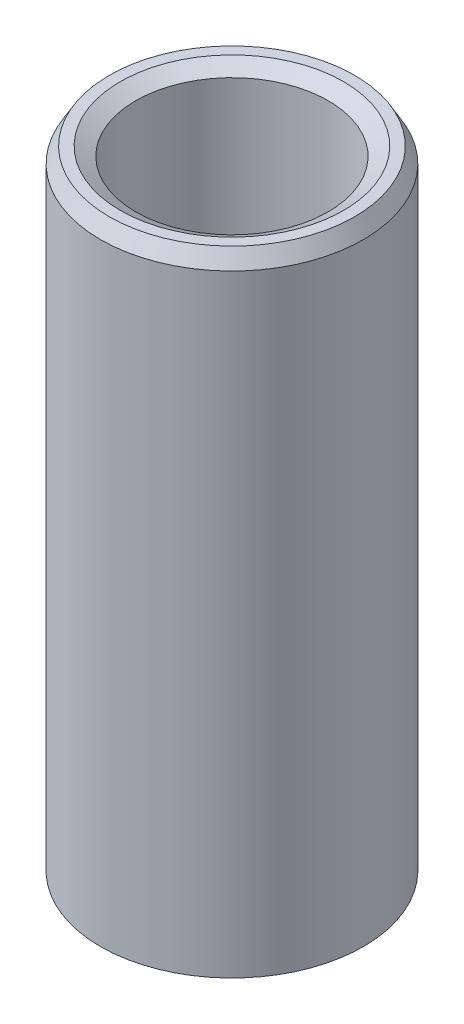
ISO-10303-21;
HEADER;
FILE_DESCRIPTION(('STEP AP214'),'2;1');
FILE_NAME('part.step','',(''),(''),'','','');
FILE_SCHEMA(('AUTOMOTIVE_DESIGN { 1 0 10303 214 1 1 1 1 }'));
ENDSEC;
DATA;
#1=APPLICATION_CONTEXT('core data for automotive mechanical design processes');
#2=APPLICATION_PROTOCOL_DEFINITION('international standard','automotive_design',2000,#1);
#3=PRODUCT_CONTEXT('',#1,'mechanical');
#4=PRODUCT('Part','Part','',(#3));
#5=PRODUCT_RELATED_PRODUCT_CATEGORY('part','',(#4));
#6=PRODUCT_DEFINITION_FORMATION('','',#4);
#7=PRODUCT_DEFINITION_CONTEXT('part definition',#1,'design');
#8=PRODUCT_DEFINITION('design','',#6,#7);
#9=PRODUCT_DEFINITION_SHAPE('','',#8);
#10=(LENGTH_UNIT() NAMED_UNIT(*) SI_UNIT(.MILLI.,.METRE.));
#11=(NAMED_UNIT(*) PLANE_ANGLE_UNIT() SI_UNIT($,.RADIAN.));
#12=(NAMED_UNIT(*) SI_UNIT($,.STERADIAN.) SOLID_ANGLE_UNIT());
#13=UNCERTAINTY_MEASURE_WITH_UNIT(LENGTH_MEASURE(1.E-05),#10,'distance_accuracy_value','');
#14=(GEOMETRIC_REPRESENTATION_CONTEXT(3) GLOBAL_UNCERTAINTY_ASSIGNED_CONTEXT((#13)) GLOBAL_UNIT_ASSIGNED_CONTEXT((#10,
#11,#12)) REPRESENTATION_CONTEXT('',''));
#15=CARTESIAN_POINT('',(0.,0.,0.));
#16=DIRECTION('',(0.,0.,1.));
#17=DIRECTION('',(1.,0.,0.));
#18=AXIS2_PLACEMENT_3D('',#15,#16,#17);
#19=CARTESIAN_POINT('',(0.,133.156342285421,0.));
#20=DIRECTION('',(0.,-1.,0.));
#21=DIRECTION('',(0.,0.,-1.));
#22=AXIS2_PLACEMENT_3D('',#19,#20,#21);
#23=CYLINDRICAL_SURFACE('',#22,27.5);
#24=CARTESIAN_POINT('',(0.,1.85242086561793,0.));
#25=DIRECTION('',(0.,1.,0.));
#26=DIRECTION('',(0.,0.,1.));
#27=AXIS2_PLACEMENT_3D('',#24,#25,#26);
#28=CIRCLE('',#27,27.5);
#29=CARTESIAN_POINT('',(0.,1.85242086561793,27.5));
#30=VERTEX_POINT('',#29);
#31=EDGE_CURVE('E10',#30,#30,#28,.T.);
#32=ORIENTED_EDGE('',*,*,#31,.T.);
#33=EDGE_LOOP('',(#32));
#34=FACE_BOUND('',#33,.T.);
#35=CARTESIAN_POINT('',(0.,129.94785522917,0.));
#36=DIRECTION('',(0.,1.,0.));
#37=DIRECTION('',(0.,0.,1.));
#38=AXIS2_PLACEMENT_3D('',#35,#36,#37);
#39=CIRCLE('',#38,27.5);
#40=CARTESIAN_POINT('',(0.,129.94785522917,27.5));
#41=VERTEX_POINT('',#40);
#42=EDGE_CURVE('E50',#41,#41,#39,.F.);
#43=ORIENTED_EDGE('',*,*,#42,.T.);
#44=EDGE_LOOP('',(#43));
#45=FACE_BOUND('',#44,.T.);
#46=ADVANCED_FACE('F39',(#34,#45),#23,.T.);
#47=CARTESIAN_POINT('',(0.,133.156342285421,0.));
#48=DIRECTION('',(0.,1.,0.));
#49=DIRECTION('',(0.,0.,1.));
#50=AXIS2_PLACEMENT_3D('',#47,#48,#49);
#51=PLANE('',#50);
#52=CARTESIAN_POINT('',(0.,133.156342285421,0.));
#53=DIRECTION('',(0.,1.,0.));
#54=DIRECTION('',(0.,0.,1.));
#55=AXIS2_PLACEMENT_3D('',#52,#53,#54);
#56=CIRCLE('',#55,23.3527264931606);
#57=CARTESIAN_POINT('',(0.,133.156342285421,23.3527264931605));
#58=VERTEX_POINT('',#57);
#59=EDGE_CURVE('E58',#58,#58,#56,.F.);
#60=ORIENTED_EDGE('',*,*,#59,.T.);
#61=EDGE_LOOP('',(#60));
#62=FACE_BOUND('',#61,.T.);
#63=CARTESIAN_POINT('',(0.,133.156342285421,0.));
#64=DIRECTION('',(0.,1.,0.));
#65=DIRECTION('',(0.,0.,1.));
#66=AXIS2_PLACEMENT_3D('',#63,#64,#65);
#67=CIRCLE('',#66,25.647579134382);
#68=CARTESIAN_POINT('',(0.,133.156342285421,25.647579134382));
#69=VERTEX_POINT('',#68);
#70=EDGE_CURVE('E61',#69,#69,#67,.T.);
#71=ORIENTED_EDGE('',*,*,#70,.T.);
#72=EDGE_LOOP('',(#71));
#73=FACE_BOUND('',#72,.T.);
#74=ADVANCED_FACE('F88',(#62,#73),#51,.T.);
#75=CARTESIAN_POINT('',(0.,0.,0.));
#76=DIRECTION('',(0.,1.,0.));
#77=DIRECTION('',(0.,0.,1.));
#78=AXIS2_PLACEMENT_3D('',#75,#76,#77);
#79=PLANE('',#78);
#80=CARTESIAN_POINT('',(0.,0.,0.));
#81=DIRECTION('',(0.,1.,0.));
#82=DIRECTION('',(0.,0.,1.));
#83=AXIS2_PLACEMENT_3D('',#80,#81,#82);
#84=CIRCLE('',#83,21.9966603025275);
#85=CARTESIAN_POINT('',(0.,0.,21.9966603025275));
#86=VERTEX_POINT('',#85);
#87=EDGE_CURVE('E51',#86,#86,#84,.T.);
#88=ORIENTED_EDGE('',*,*,#87,.T.);
#89=EDGE_LOOP('',(#88));
#90=FACE_BOUND('',#89,.T.);
#91=CARTESIAN_POINT('',(0.,0.,0.));
#92=DIRECTION('',(0.,1.,0.));
#93=DIRECTION('',(0.,0.,1.));
#94=AXIS2_PLACEMENT_3D('',#91,#92,#93);
#95=CIRCLE('',#94,24.291512943749);
#96=CARTESIAN_POINT('',(0.,0.,24.291512943749));
#97=VERTEX_POINT('',#96);
#98=EDGE_CURVE('E54',#97,#97,#95,.F.);
#99=ORIENTED_EDGE('',*,*,#98,.T.);
#100=EDGE_LOOP('',(#99));
#101=FACE_BOUND('',#100,.T.);
#102=ADVANCED_FACE('F83',(#90,#101),#79,.F.);
#103=CARTESIAN_POINT('',(0.,133.156342285421,0.));
#104=DIRECTION('',(0.,-1.,0.));
#105=DIRECTION('',(0.,0.,-1.));
#106=AXIS2_PLACEMENT_3D('',#103,#104,#105);
#107=CYLINDRICAL_SURFACE('',#106,20.1442394369096);
#108=CARTESIAN_POINT('',(0.,131.303921419804,0.));
#109=DIRECTION('',(0.,1.,0.));
#110=DIRECTION('',(0.,0.,1.));
#111=AXIS2_PLACEMENT_3D('',#108,#109,#110);
#112=CIRCLE('',#111,20.1442394369096);
#113=CARTESIAN_POINT('',(0.,131.303921419804,20.1442394369096));
#114=VERTEX_POINT('',#113);
#115=EDGE_CURVE('E67',#114,#114,#112,.T.);
#116=ORIENTED_EDGE('',*,*,#115,.T.);
#117=EDGE_LOOP('',(#116));
#118=FACE_BOUND('',#117,.T.);
#119=CARTESIAN_POINT('',(0.,3.20848705625099,0.));
#120=DIRECTION('',(0.,1.,0.));
#121=DIRECTION('',(0.,0.,1.));
#122=AXIS2_PLACEMENT_3D('',#119,#120,#121);
#123=CIRCLE('',#122,20.1442394369096);
#124=CARTESIAN_POINT('',(0.,3.20848705625099,20.1442394369096));
#125=VERTEX_POINT('',#124);
#126=EDGE_CURVE('E69',#125,#125,#123,.F.);
#127=ORIENTED_EDGE('',*,*,#126,.T.);
#128=EDGE_LOOP('',(#127));
#129=FACE_BOUND('',#128,.T.);
#130=ADVANCED_FACE('F71',(#118,#129),#107,.F.);
#131=CARTESIAN_POINT('',(0.,131.303921419804,0.));
#132=DIRECTION('',(0.,1.,0.));
#133=DIRECTION('',(0.,0.,1.));
#134=AXIS2_PLACEMENT_3D('',#131,#132,#133);
#135=CONICAL_SURFACE('',#134,20.1442394369096,1.0471975511966);
#136=CARTESIAN_POINT('',(0.,133.156342285421,23.3527264931605));
#137=CARTESIAN_POINT('',(0.,133.137046234738,23.3193047529913));
#138=CARTESIAN_POINT('',(0.,133.117750184054,23.285883012822));
#139=CARTESIAN_POINT('',(0.,133.079158082687,23.2190395324834));
#140=CARTESIAN_POINT('',(0.,133.059862032004,23.1856177923141));
#141=CARTESIAN_POINT('',(0.,133.021269930637,23.1187743119756));
#142=CARTESIAN_POINT('',(0.,133.001973879953,23.0853525718063));
#143=CARTESIAN_POINT('',(0.,132.963381778586,23.0185090914677));
#144=CARTESIAN_POINT('',(0.,132.944085727903,22.9850873512984));
#145=CARTESIAN_POINT('',(0.,132.905493626536,22.9182438709599));
#146=CARTESIAN_POINT('',(0.,132.886197575852,22.8848221307906));
#147=CARTESIAN_POINT('',(0.,132.847605474485,22.817978650452));
#148=CARTESIAN_POINT('',(0.,132.828309423802,22.7845569102828));
#149=CARTESIAN_POINT('',(0.,132.789717322435,22.7177134299442));
#150=CARTESIAN_POINT('',(0.,132.770421271751,22.6842916897749));
#151=CARTESIAN_POINT('',(0.,132.731829170384,22.6174482094364));
#152=CARTESIAN_POINT('',(0.,132.7125331197,22.5840264692671));
#153=CARTESIAN_POINT('',(0.,132.673941018333,22.5171829889285));
#154=CARTESIAN_POINT('',(0.,132.65464496765,22.4837612487592));
#155=CARTESIAN_POINT('',(0.,132.616052866283,22.4169177684207));
#156=CARTESIAN_POINT('',(0.,132.596756815599,22.3834960282514));
#157=CARTESIAN_POINT('',(0.,132.558164714232,22.3166525479128));
#158=CARTESIAN_POINT('',(0.,132.538868663549,22.2832308077435));
#159=CARTESIAN_POINT('',(0.,132.500276562182,22.216387327405));
#160=CARTESIAN_POINT('',(0.,132.480980511498,22.1829655872357));
#161=CARTESIAN_POINT('',(0.,132.442388410131,22.1161221068971));
#162=CARTESIAN_POINT('',(0.,132.423092359448,22.0827003667279));
#163=CARTESIAN_POINT('',(0.,132.384500258081,22.0158568863893));
#164=CARTESIAN_POINT('',(0.,132.365204207397,21.98243514622));
#165=CARTESIAN_POINT('',(0.,132.32661210603,21.9155916658815));
#166=CARTESIAN_POINT('',(0.,132.307316055347,21.8821699257122));
#167=CARTESIAN_POINT('',(0.,132.26872395398,21.8153264453736));
#168=CARTESIAN_POINT('',(0.,132.249427903296,21.7819047052043));
#169=CARTESIAN_POINT('',(0.,132.210835801929,21.7150612248658));
#170=CARTESIAN_POINT('',(0.,132.191539751245,21.6816394846965));
#171=CARTESIAN_POINT('',(0.,132.152947649878,21.6147960043579));
#172=CARTESIAN_POINT('',(0.,132.133651599195,21.5813742641886));
#173=CARTESIAN_POINT('',(0.,132.095059497828,21.5145307838501));
#174=CARTESIAN_POINT('',(0.,132.075763447144,21.4811090436808));
#175=CARTESIAN_POINT('',(0.,132.037171345777,21.4142655633422));
#176=CARTESIAN_POINT('',(0.,132.017875295094,21.380843823173));
#177=CARTESIAN_POINT('',(0.,131.979283193727,21.3140003428344));
#178=CARTESIAN_POINT('',(0.,131.959987143043,21.2805786026651));
#179=CARTESIAN_POINT('',(0.,131.921395041676,21.2137351223266));
#180=CARTESIAN_POINT('',(0.,131.902098990993,21.1803133821573));
#181=CARTESIAN_POINT('',(0.,131.863506889626,21.1134699018187));
#182=CARTESIAN_POINT('',(0.,131.844210838942,21.0800481616494));
#183=CARTESIAN_POINT('',(0.,131.805618737575,21.0132046813109));
#184=CARTESIAN_POINT('',(0.,131.786322686892,20.9797829411416));
#185=CARTESIAN_POINT('',(0.,131.747730585524,20.912939460803));
#186=CARTESIAN_POINT('',(0.,131.728434534841,20.8795177206338));
#187=CARTESIAN_POINT('',(0.,131.689842433474,20.8126742402952));
#188=CARTESIAN_POINT('',(0.,131.67054638279,20.7792525001259));
#189=CARTESIAN_POINT('',(0.,131.631954281423,20.7124090197873));
#190=CARTESIAN_POINT('',(0.,131.61265823074,20.6789872796181));
#191=CARTESIAN_POINT('',(0.,131.574066129373,20.6121437992795));
#192=CARTESIAN_POINT('',(0.,131.554770078689,20.5787220591102));
#193=CARTESIAN_POINT('',(0.,131.516177977322,20.5118785787717));
#194=CARTESIAN_POINT('',(0.,131.496881926639,20.4784568386024));
#195=CARTESIAN_POINT('',(0.,131.458289825272,20.4116133582638));
#196=CARTESIAN_POINT('',(0.,131.438993774588,20.3781916180945));
#197=CARTESIAN_POINT('',(0.,131.400401673221,20.311348137756));
#198=CARTESIAN_POINT('',(0.,131.381105622538,20.2779263975867));
#199=CARTESIAN_POINT('',(0.,131.342513521171,20.2110829172481));
#200=CARTESIAN_POINT('',(0.,131.323217470487,20.1776611770789));
#201=CARTESIAN_POINT('',(0.,131.303921419804,20.1442394369096));
#202=B_SPLINE_CURVE_WITH_KNOTS('',3,(#136,#137,#138,#139,#140,#141,#142,#143,#144,#145,#146,
#147,#148,#149,#150,#151,#152,#153,#154,#155,#156,#157,#158,#159,#160,#161,#162,#163,#164,#165,
#166,#167,#168,#169,#170,#171,#172,#173,#174,#175,#176,#177,#178,#179,#180,#181,#182,#183,#184,
#185,#186,#187,#188,#189,#190,#191,#192,#193,#194,#195,#196,#197,#198,#199,#200,#201),
.UNSPECIFIED.,.F.,.F.,(4,2,2,2,2,2,2,2,2,2,2,2,2,2,2,2,2,2,2,2,2,2,2,2,2,2,2,2,2,2,2,2,4),(0.,
0.115776304101124,0.231552608202251,0.347328912303364,0.463105216404491,0.578881520505604,
0.694657824606731,0.810434128707842,0.926210432808969,1.0419867369101,1.15776304101121,
1.27353934511234,1.38931564921345,1.50509195331457,1.62086825741569,1.73664456151681,
1.85242086561793,1.96819716971905,2.08397347382018,2.19974977792129,2.31552608202242,
2.43130238612353,2.54707869022466,2.66285499432577,2.77863129842689,2.89440760252802,
3.01018390662913,3.12596021073026,3.24173651483137,3.3575128189325,3.47328912303361,
3.58906542713474,3.70484173123585),.UNSPECIFIED.);
#203=EDGE_CURVE('BSEAM77',#58,#114,#202,.T.);
#204=ORIENTED_EDGE('',*,*,#59,.F.);
#205=ORIENTED_EDGE('',*,*,#115,.F.);
#206=ORIENTED_EDGE('',*,*,#203,.T.);
#207=ORIENTED_EDGE('',*,*,#203,.F.);
#208=EDGE_LOOP('',(#204,#206,#205,#207));
#209=FACE_BOUND('',#208,.T.);
#210=ADVANCED_FACE('F77',(#209),#135,.F.);
#211=CARTESIAN_POINT('',(0.,0.,0.));
#212=DIRECTION('',(0.,-1.,0.));
#213=DIRECTION('',(0.,0.,-1.));
#214=AXIS2_PLACEMENT_3D('',#211,#212,#213);
#215=CONICAL_SURFACE('',#214,21.9966603025275,0.523598775598298);
#216=ORIENTED_EDGE('',*,*,#126,.F.);
#217=EDGE_LOOP('',(#216));
#218=FACE_BOUND('',#217,.T.);
#219=ORIENTED_EDGE('',*,*,#87,.F.);
#220=EDGE_LOOP('',(#219));
#221=FACE_BOUND('',#220,.T.);
#222=ADVANCED_FACE('F73',(#218,#221),#215,.F.);
#223=CARTESIAN_POINT('',(0.,1.85242086561793,0.));
#224=DIRECTION('',(0.,1.,0.));
#225=DIRECTION('',(0.,0.,1.));
#226=AXIS2_PLACEMENT_3D('',#223,#224,#225);
#227=CONICAL_SURFACE('',#226,27.5,1.0471975511966);
#228=CARTESIAN_POINT('',(0.,0.,24.291512943749));
#229=CARTESIAN_POINT('',(0.,0.0192960506835199,24.3249346839183));
#230=CARTESIAN_POINT('',(0.,0.03859210136704,24.3583564240876));
#231=CARTESIAN_POINT('',(0.,0.0771842027340803,24.4251999044261));
#232=CARTESIAN_POINT('',(0.,0.0964802534176004,24.4586216445954));
#233=CARTESIAN_POINT('',(0.,0.135072354784641,24.525465124934));
#234=CARTESIAN_POINT('',(0.,0.154368405468161,24.5588868651033));
#235=CARTESIAN_POINT('',(0.,0.192960506835201,24.6257303454418));
#236=CARTESIAN_POINT('',(0.,0.212256557518721,24.6591520856111));
#237=CARTESIAN_POINT('',(0.,0.250848658885761,24.7259955659497));
#238=CARTESIAN_POINT('',(0.,0.270144709569282,24.7594173061189));
#239=CARTESIAN_POINT('',(0.,0.308736810936322,24.8262607864575));
#240=CARTESIAN_POINT('',(0.,0.328032861619842,24.8596825266268));
#241=CARTESIAN_POINT('',(0.,0.366624962986882,24.9265260069654));
#242=CARTESIAN_POINT('',(0.,0.385921013670402,24.9599477471346));
#243=CARTESIAN_POINT('',(0.,0.424513115037443,25.0267912274732));
#244=CARTESIAN_POINT('',(0.,0.443809165720963,25.0602129676425));
#245=CARTESIAN_POINT('',(0.,0.482401267088003,25.127056447981));
#246=CARTESIAN_POINT('',(0.,0.501697317771523,25.1604781881503));
#247=CARTESIAN_POINT('',(0.,0.540289419138563,25.2273216684889));
#248=CARTESIAN_POINT('',(0.,0.559585469822083,25.2607434086582));
#249=CARTESIAN_POINT('',(0.,0.598177571189124,25.3275868889967));
#250=CARTESIAN_POINT('',(0.,0.617473621872644,25.361008629166));
#251=CARTESIAN_POINT('',(0.,0.656065723239684,25.4278521095046));
#252=CARTESIAN_POINT('',(0.,0.675361773923204,25.4612738496738));
#253=CARTESIAN_POINT('',(0.,0.713953875290244,25.5281173300124));
#254=CARTESIAN_POINT('',(0.,0.733249925973765,25.5615390701817));
#255=CARTESIAN_POINT('',(0.,0.771842027340805,25.6283825505203));
#256=CARTESIAN_POINT('',(0.,0.791138078024325,25.6618042906895));
#257=CARTESIAN_POINT('',(0.,0.829730179391365,25.7286477710281));
#258=CARTESIAN_POINT('',(0.,0.849026230074885,25.7620695111974));
#259=CARTESIAN_POINT('',(0.,0.887618331441926,25.8289129915359));
#260=CARTESIAN_POINT('',(0.,0.906914382125446,25.8623347317052));
#261=CARTESIAN_POINT('',(0.,0.945506483492486,25.9291782120438));
#262=CARTESIAN_POINT('',(0.,0.964802534176006,25.9625999522131));
#263=CARTESIAN_POINT('',(0.,1.00339463554305,26.0294434325516));
#264=CARTESIAN_POINT('',(0.,1.02269068622657,26.0628651727209));
#265=CARTESIAN_POINT('',(0.,1.06128278759361,26.1297086530595));
#266=CARTESIAN_POINT('',(0.,1.08057883827713,26.1631303932288));
#267=CARTESIAN_POINT('',(0.,1.11917093964417,26.2299738735673));
#268=CARTESIAN_POINT('',(0.,1.13846699032769,26.2633956137366));
#269=CARTESIAN_POINT('',(0.,1.17705909169473,26.3302390940752));
#270=CARTESIAN_POINT('',(0.,1.19635514237825,26.3636608342444));
#271=CARTESIAN_POINT('',(0.,1.23494724374529,26.430504314583));
#272=CARTESIAN_POINT('',(0.,1.25424329442881,26.4639260547523));
#273=CARTESIAN_POINT('',(0.,1.29283539579585,26.5307695350908));
#274=CARTESIAN_POINT('',(0.,1.31213144647937,26.5641912752601));
#275=CARTESIAN_POINT('',(0.,1.35072354784641,26.6310347555987));
#276=CARTESIAN_POINT('',(0.,1.37001959852993,26.664456495768));
#277=CARTESIAN_POINT('',(0.,1.40861169989697,26.7312999761065));
#278=CARTESIAN_POINT('',(0.,1.42790775058049,26.7647217162758));
#279=CARTESIAN_POINT('',(0.,1.46649985194753,26.8315651966144));
#280=CARTESIAN_POINT('',(0.,1.48579590263105,26.8649869367837));
#281=CARTESIAN_POINT('',(0.,1.52438800399809,26.9318304171222));
#282=CARTESIAN_POINT('',(0.,1.54368405468161,26.9652521572915));
#283=CARTESIAN_POINT('',(0.,1.58227615604865,27.0320956376301));
#284=CARTESIAN_POINT('',(0.,1.60157220673217,27.0655173777993));
#285=CARTESIAN_POINT('',(0.,1.64016430809921,27.1323608581379));
#286=CARTESIAN_POINT('',(0.,1.65946035878273,27.1657825983072));
#287=CARTESIAN_POINT('',(0.,1.69805246014977,27.2326260786458));
#288=CARTESIAN_POINT('',(0.,1.71734851083329,27.266047818815));
#289=CARTESIAN_POINT('',(0.,1.75594061220033,27.3328912991536));
#290=CARTESIAN_POINT('',(0.,1.77523666288385,27.3663130393229));
#291=CARTESIAN_POINT('',(0.,1.81382876425089,27.4331565196614));
#292=CARTESIAN_POINT('',(0.,1.83312481493441,27.4665782598307));
#293=CARTESIAN_POINT('',(0.,1.85242086561793,27.5));
#294=B_SPLINE_CURVE_WITH_KNOTS('',3,(#228,#229,#230,#231,#232,#233,#234,#235,#236,#237,#238,
#239,#240,#241,#242,#243,#244,#245,#246,#247,#248,#249,#250,#251,#252,#253,#254,#255,#256,#257,
#258,#259,#260,#261,#262,#263,#264,#265,#266,#267,#268,#269,#270,#271,#272,#273,#274,#275,#276,
#277,#278,#279,#280,#281,#282,#283,#284,#285,#286,#287,#288,#289,#290,#291,#292,#293),
.UNSPECIFIED.,.F.,.F.,(4,2,2,2,2,2,2,2,2,2,2,2,2,2,2,2,2,2,2,2,2,2,2,2,2,2,2,2,2,2,2,2,4),(0.,
0.115776304101121,0.231552608202242,0.347328912303363,0.463105216404484,0.578881520505605,
0.694657824606726,0.810434128707847,0.926210432808968,1.04198673691009,1.15776304101121,
1.27353934511233,1.38931564921345,1.50509195331458,1.6208682574157,1.73664456151682,
1.85242086561794,1.96819716971906,2.08397347382018,2.1997497779213,2.31552608202242,
2.43130238612354,2.54707869022466,2.66285499432578,2.7786312984269,2.89440760252803,
3.01018390662915,3.12596021073027,3.24173651483139,3.35751281893251,3.47328912303363,
3.58906542713475,3.70484173123587),.UNSPECIFIED.);
#295=EDGE_CURVE('BSEAM76',#97,#30,#294,.T.);
#296=ORIENTED_EDGE('',*,*,#98,.F.);
#297=ORIENTED_EDGE('',*,*,#31,.F.);
#298=ORIENTED_EDGE('',*,*,#295,.T.);
#299=ORIENTED_EDGE('',*,*,#295,.F.);
#300=EDGE_LOOP('',(#296,#298,#297,#299));
#301=FACE_BOUND('',#300,.T.);
#302=ADVANCED_FACE('F76',(#301),#227,.T.);
#303=CARTESIAN_POINT('',(0.,133.156342285421,0.));
#304=DIRECTION('',(0.,-1.,0.));
#305=DIRECTION('',(0.,0.,-1.));
#306=AXIS2_PLACEMENT_3D('',#303,#304,#305);
#307=CONICAL_SURFACE('',#306,25.647579134382,0.523598775598297);
#308=ORIENTED_EDGE('',*,*,#42,.F.);
#309=EDGE_LOOP('',(#308));
#310=FACE_BOUND('',#309,.T.);
#311=ORIENTED_EDGE('',*,*,#70,.F.);
#312=EDGE_LOOP('',(#311));
#313=FACE_BOUND('',#312,.T.);
#314=ADVANCED_FACE('F45',(#310,#313),#307,.T.);
#315=CLOSED_SHELL('',(#46,#74,#102,#130,#210,#222,#302,#314));
#316=MANIFOLD_SOLID_BREP('B2',#315);
#317=ADVANCED_BREP_SHAPE_REPRESENTATION('',(#18,#316),#14);
#318=SHAPE_DEFINITION_REPRESENTATION(#9,#317);
ENDSEC;
END-ISO-10303-21;
